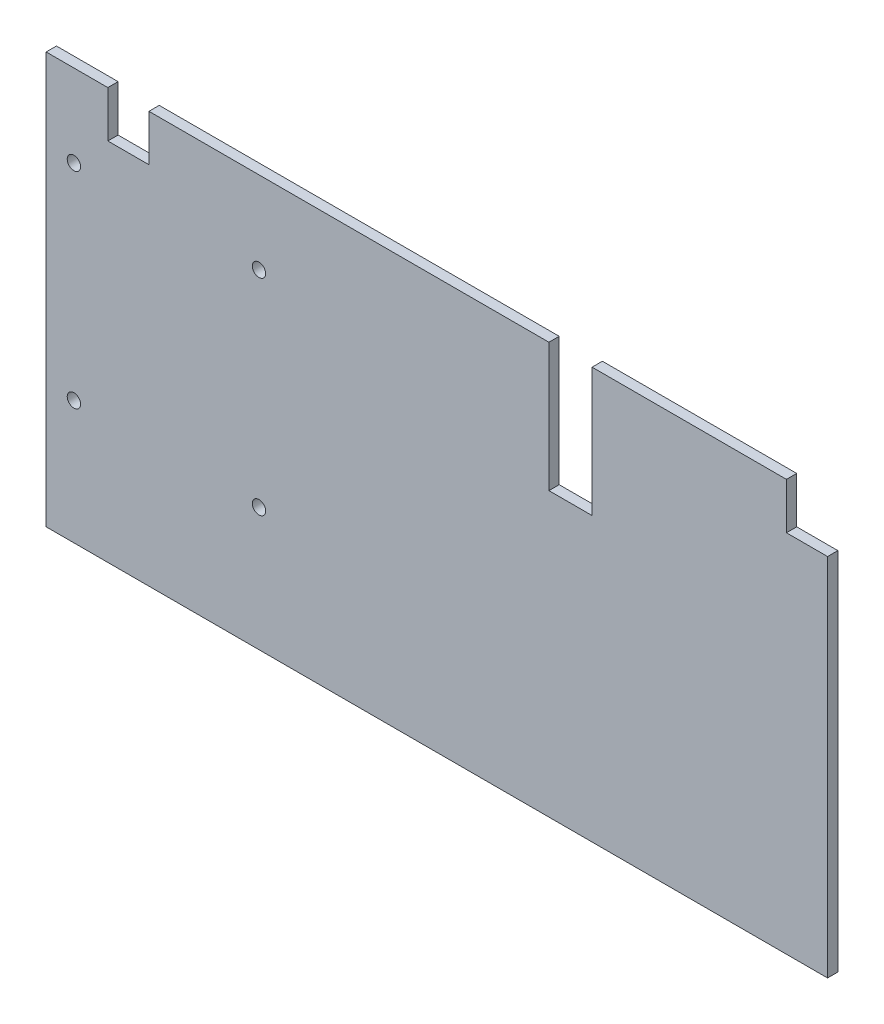
ISO-10303-21;
HEADER;
FILE_DESCRIPTION(('STEP AP214'),'2;1');
FILE_NAME('part.step','',(''),(''),'','','');
FILE_SCHEMA(('AUTOMOTIVE_DESIGN { 1 0 10303 214 1 1 1 1 }'));
ENDSEC;
DATA;
#1=APPLICATION_CONTEXT('core data for automotive mechanical design processes');
#2=APPLICATION_PROTOCOL_DEFINITION('international standard','automotive_design',2000,#1);
#3=PRODUCT_CONTEXT('',#1,'mechanical');
#4=PRODUCT('Part','Part','',(#3));
#5=PRODUCT_RELATED_PRODUCT_CATEGORY('part','',(#4));
#6=PRODUCT_DEFINITION_FORMATION('','',#4);
#7=PRODUCT_DEFINITION_CONTEXT('part definition',#1,'design');
#8=PRODUCT_DEFINITION('design','',#6,#7);
#9=PRODUCT_DEFINITION_SHAPE('','',#8);
#10=(LENGTH_UNIT() NAMED_UNIT(*) SI_UNIT(.MILLI.,.METRE.));
#11=(NAMED_UNIT(*) PLANE_ANGLE_UNIT() SI_UNIT($,.RADIAN.));
#12=(NAMED_UNIT(*) SI_UNIT($,.STERADIAN.) SOLID_ANGLE_UNIT());
#13=UNCERTAINTY_MEASURE_WITH_UNIT(LENGTH_MEASURE(1.E-05),#10,'distance_accuracy_value','');
#14=(GEOMETRIC_REPRESENTATION_CONTEXT(3) GLOBAL_UNCERTAINTY_ASSIGNED_CONTEXT((#13)) GLOBAL_UNIT_ASSIGNED_CONTEXT((#10,
#11,#12)) REPRESENTATION_CONTEXT('',''));
#15=CARTESIAN_POINT('',(0.,0.,0.));
#16=DIRECTION('',(0.,0.,1.));
#17=DIRECTION('',(1.,0.,0.));
#18=AXIS2_PLACEMENT_3D('',#15,#16,#17);
#19=CARTESIAN_POINT('',(0.,0.,10.));
#20=DIRECTION('',(0.,0.,1.));
#21=DIRECTION('',(1.,0.,0.));
#22=AXIS2_PLACEMENT_3D('',#19,#20,#21);
#23=PLANE('',#22);
#24=CARTESIAN_POINT('',(-303.,-100.,10.));
#25=DIRECTION('',(0.,0.,1.));
#26=DIRECTION('',(-1.,0.,0.));
#27=AXIS2_PLACEMENT_3D('',#24,#25,#26);
#28=CIRCLE('',#27,6.50000000000002);
#29=CARTESIAN_POINT('',(-309.5,-100.,10.));
#30=VERTEX_POINT('',#29);
#31=EDGE_CURVE('E321',#30,#30,#28,.T.);
#32=ORIENTED_EDGE('',*,*,#31,.F.);
#33=EDGE_LOOP('',(#32));
#34=FACE_BOUND('',#33,.T.);
#35=CARTESIAN_POINT('',(-303.,100.,10.));
#36=DIRECTION('',(0.,0.,1.));
#37=DIRECTION('',(1.,0.,0.));
#38=AXIS2_PLACEMENT_3D('',#35,#36,#37);
#39=CIRCLE('',#38,6.50000000000002);
#40=CARTESIAN_POINT('',(-296.5,100.,10.));
#41=VERTEX_POINT('',#40);
#42=EDGE_CURVE('E174',#41,#41,#39,.T.);
#43=ORIENTED_EDGE('',*,*,#42,.F.);
#44=EDGE_LOOP('',(#43));
#45=FACE_BOUND('',#44,.T.);
#46=DIRECTION('',(0.,1.,0.));
#47=VECTOR('',#46,1.);
#48=CARTESIAN_POINT('',(-20.9999999999999,55.,10.));
#49=LINE('',#48,#47);
#50=CARTESIAN_POINT('',(-20.9999999999999,55.,10.));
#51=VERTEX_POINT('',#50);
#52=CARTESIAN_POINT('',(-21.,180.,10.));
#53=VERTEX_POINT('',#52);
#54=EDGE_CURVE('E197',#51,#53,#49,.T.);
#55=ORIENTED_EDGE('',*,*,#54,.T.);
#56=DIRECTION('',(-1.,0.,0.));
#57=VECTOR('',#56,1.);
#58=CARTESIAN_POINT('',(-21.,180.,10.));
#59=LINE('',#58,#57);
#60=CARTESIAN_POINT('',(-410.,180.,10.));
#61=VERTEX_POINT('',#60);
#62=EDGE_CURVE('E115',#53,#61,#59,.T.);
#63=ORIENTED_EDGE('',*,*,#62,.T.);
#64=DIRECTION('',(0.,-1.,0.));
#65=VECTOR('',#64,1.);
#66=CARTESIAN_POINT('',(-410.,180.,10.));
#67=LINE('',#66,#65);
#68=CARTESIAN_POINT('',(-410.,135.,10.));
#69=VERTEX_POINT('',#68);
#70=EDGE_CURVE('E230',#61,#69,#67,.T.);
#71=ORIENTED_EDGE('',*,*,#70,.T.);
#72=DIRECTION('',(-1.,0.,0.));
#73=VECTOR('',#72,1.);
#74=CARTESIAN_POINT('',(-410.,135.,10.));
#75=LINE('',#74,#73);
#76=CARTESIAN_POINT('',(-450.,135.,10.));
#77=VERTEX_POINT('',#76);
#78=EDGE_CURVE('E249',#69,#77,#75,.T.);
#79=ORIENTED_EDGE('',*,*,#78,.T.);
#80=DIRECTION('',(0.,1.,0.));
#81=VECTOR('',#80,1.);
#82=CARTESIAN_POINT('',(-450.,135.,10.));
#83=LINE('',#82,#81);
#84=CARTESIAN_POINT('',(-450.,180.,10.));
#85=VERTEX_POINT('',#84);
#86=EDGE_CURVE('E246',#77,#85,#83,.T.);
#87=ORIENTED_EDGE('',*,*,#86,.T.);
#88=DIRECTION('',(-1.,0.,0.));
#89=VECTOR('',#88,1.);
#90=CARTESIAN_POINT('',(-450.,180.,10.));
#91=LINE('',#90,#89);
#92=CARTESIAN_POINT('',(-510.,180.,10.));
#93=VERTEX_POINT('',#92);
#94=EDGE_CURVE('E248',#85,#93,#91,.T.);
#95=ORIENTED_EDGE('',*,*,#94,.T.);
#96=DIRECTION('',(0.,-1.,0.));
#97=VECTOR('',#96,1.);
#98=CARTESIAN_POINT('',(-510.,180.,10.));
#99=LINE('',#98,#97);
#100=CARTESIAN_POINT('',(-510.,-220.,10.));
#101=VERTEX_POINT('',#100);
#102=EDGE_CURVE('E251',#93,#101,#99,.T.);
#103=ORIENTED_EDGE('',*,*,#102,.T.);
#104=DIRECTION('',(1.,0.,0.));
#105=VECTOR('',#104,1.);
#106=CARTESIAN_POINT('',(-510.,-220.,10.));
#107=LINE('',#106,#105);
#108=CARTESIAN_POINT('',(250.,-220.,10.));
#109=VERTEX_POINT('',#108);
#110=EDGE_CURVE('E257',#101,#109,#107,.T.);
#111=ORIENTED_EDGE('',*,*,#110,.T.);
#112=DIRECTION('',(0.,1.,0.));
#113=VECTOR('',#112,1.);
#114=CARTESIAN_POINT('',(250.,135.,10.));
#115=LINE('',#114,#113);
#116=CARTESIAN_POINT('',(250.,135.,10.));
#117=VERTEX_POINT('',#116);
#118=EDGE_CURVE('E259',#109,#117,#115,.T.);
#119=ORIENTED_EDGE('',*,*,#118,.T.);
#120=DIRECTION('',(-1.,0.,0.));
#121=VECTOR('',#120,1.);
#122=CARTESIAN_POINT('',(210.,135.,10.));
#123=LINE('',#122,#121);
#124=CARTESIAN_POINT('',(210.,135.,10.));
#125=VERTEX_POINT('',#124);
#126=EDGE_CURVE('E261',#117,#125,#123,.T.);
#127=ORIENTED_EDGE('',*,*,#126,.T.);
#128=DIRECTION('',(0.,1.,0.));
#129=VECTOR('',#128,1.);
#130=CARTESIAN_POINT('',(210.,180.,10.));
#131=LINE('',#130,#129);
#132=CARTESIAN_POINT('',(210.,180.,10.));
#133=VERTEX_POINT('',#132);
#134=EDGE_CURVE('E152',#125,#133,#131,.T.);
#135=ORIENTED_EDGE('',*,*,#134,.T.);
#136=DIRECTION('',(-1.,0.,0.));
#137=VECTOR('',#136,1.);
#138=CARTESIAN_POINT('',(21.,180.,10.));
#139=LINE('',#138,#137);
#140=CARTESIAN_POINT('',(21.,180.,10.));
#141=VERTEX_POINT('',#140);
#142=EDGE_CURVE('E146',#133,#141,#139,.T.);
#143=ORIENTED_EDGE('',*,*,#142,.T.);
#144=DIRECTION('',(0.,-1.,0.));
#145=VECTOR('',#144,1.);
#146=CARTESIAN_POINT('',(21.0000000000001,55.,10.));
#147=LINE('',#146,#145);
#148=CARTESIAN_POINT('',(21.0000000000001,55.,10.));
#149=VERTEX_POINT('',#148);
#150=EDGE_CURVE('E150',#141,#149,#147,.T.);
#151=ORIENTED_EDGE('',*,*,#150,.T.);
#152=DIRECTION('',(-1.,0.,0.));
#153=VECTOR('',#152,1.);
#154=CARTESIAN_POINT('',(-20.9999999999999,55.,10.));
#155=LINE('',#154,#153);
#156=EDGE_CURVE('E54',#149,#51,#155,.T.);
#157=ORIENTED_EDGE('',*,*,#156,.T.);
#158=EDGE_LOOP('',(#55,#63,#71,#79,#87,#95,#103,#111,#119,#127,#135,#143,#151,#157));
#159=FACE_BOUND('',#158,.T.);
#160=CARTESIAN_POINT('',(-483.,100.,10.));
#161=DIRECTION('',(0.,0.,1.));
#162=DIRECTION('',(-1.,0.,0.));
#163=AXIS2_PLACEMENT_3D('',#160,#161,#162);
#164=CIRCLE('',#163,6.50000000000002);
#165=CARTESIAN_POINT('',(-489.5,100.,10.));
#166=VERTEX_POINT('',#165);
#167=EDGE_CURVE('E327',#166,#166,#164,.T.);
#168=ORIENTED_EDGE('',*,*,#167,.F.);
#169=EDGE_LOOP('',(#168));
#170=FACE_BOUND('',#169,.T.);
#171=CARTESIAN_POINT('',(-483.,-100.,10.));
#172=DIRECTION('',(0.,0.,1.));
#173=DIRECTION('',(1.,0.,0.));
#174=AXIS2_PLACEMENT_3D('',#171,#172,#173);
#175=CIRCLE('',#174,6.50000000000002);
#176=CARTESIAN_POINT('',(-476.5,-100.,10.));
#177=VERTEX_POINT('',#176);
#178=EDGE_CURVE('E312',#177,#177,#175,.T.);
#179=ORIENTED_EDGE('',*,*,#178,.F.);
#180=EDGE_LOOP('',(#179));
#181=FACE_BOUND('',#180,.T.);
#182=ADVANCED_FACE('F37',(#34,#45,#159,#170,#181),#23,.T.);
#183=CARTESIAN_POINT('',(0.,0.,0.));
#184=DIRECTION('',(0.,0.,1.));
#185=DIRECTION('',(1.,0.,0.));
#186=AXIS2_PLACEMENT_3D('',#183,#184,#185);
#187=PLANE('',#186);
#188=DIRECTION('',(0.,1.,0.));
#189=VECTOR('',#188,1.);
#190=CARTESIAN_POINT('',(-20.9999999999999,55.,0.));
#191=LINE('',#190,#189);
#192=CARTESIAN_POINT('',(-20.9999999999999,55.,0.));
#193=VERTEX_POINT('',#192);
#194=CARTESIAN_POINT('',(-21.,180.,0.));
#195=VERTEX_POINT('',#194);
#196=EDGE_CURVE('E170',#193,#195,#191,.T.);
#197=ORIENTED_EDGE('',*,*,#196,.F.);
#198=DIRECTION('',(-1.,0.,0.));
#199=VECTOR('',#198,1.);
#200=CARTESIAN_POINT('',(-20.9999999999999,55.,0.));
#201=LINE('',#200,#199);
#202=CARTESIAN_POINT('',(21.0000000000001,55.,0.));
#203=VERTEX_POINT('',#202);
#204=EDGE_CURVE('E107',#203,#193,#201,.T.);
#205=ORIENTED_EDGE('',*,*,#204,.F.);
#206=DIRECTION('',(0.,-1.,0.));
#207=VECTOR('',#206,1.);
#208=CARTESIAN_POINT('',(21.0000000000001,55.,0.));
#209=LINE('',#208,#207);
#210=CARTESIAN_POINT('',(21.,180.,0.));
#211=VERTEX_POINT('',#210);
#212=EDGE_CURVE('E101',#211,#203,#209,.T.);
#213=ORIENTED_EDGE('',*,*,#212,.F.);
#214=DIRECTION('',(-1.,0.,0.));
#215=VECTOR('',#214,1.);
#216=CARTESIAN_POINT('',(21.,180.,0.));
#217=LINE('',#216,#215);
#218=CARTESIAN_POINT('',(210.,180.,0.));
#219=VERTEX_POINT('',#218);
#220=EDGE_CURVE('E160',#219,#211,#217,.T.);
#221=ORIENTED_EDGE('',*,*,#220,.F.);
#222=DIRECTION('',(0.,1.,0.));
#223=VECTOR('',#222,1.);
#224=CARTESIAN_POINT('',(210.,180.,0.));
#225=LINE('',#224,#223);
#226=CARTESIAN_POINT('',(210.,135.,0.));
#227=VERTEX_POINT('',#226);
#228=EDGE_CURVE('E192',#227,#219,#225,.T.);
#229=ORIENTED_EDGE('',*,*,#228,.F.);
#230=DIRECTION('',(-1.,0.,0.));
#231=VECTOR('',#230,1.);
#232=CARTESIAN_POINT('',(210.,135.,0.));
#233=LINE('',#232,#231);
#234=CARTESIAN_POINT('',(250.,135.,0.));
#235=VERTEX_POINT('',#234);
#236=EDGE_CURVE('E190',#235,#227,#233,.T.);
#237=ORIENTED_EDGE('',*,*,#236,.F.);
#238=DIRECTION('',(0.,1.,0.));
#239=VECTOR('',#238,1.);
#240=CARTESIAN_POINT('',(250.,135.,0.));
#241=LINE('',#240,#239);
#242=CARTESIAN_POINT('',(250.,-220.,0.));
#243=VERTEX_POINT('',#242);
#244=EDGE_CURVE('E188',#243,#235,#241,.T.);
#245=ORIENTED_EDGE('',*,*,#244,.F.);
#246=DIRECTION('',(1.,0.,0.));
#247=VECTOR('',#246,1.);
#248=CARTESIAN_POINT('',(-510.,-220.,0.));
#249=LINE('',#248,#247);
#250=CARTESIAN_POINT('',(-510.,-220.,0.));
#251=VERTEX_POINT('',#250);
#252=EDGE_CURVE('E186',#251,#243,#249,.T.);
#253=ORIENTED_EDGE('',*,*,#252,.F.);
#254=DIRECTION('',(0.,-1.,0.));
#255=VECTOR('',#254,1.);
#256=CARTESIAN_POINT('',(-510.,180.,0.));
#257=LINE('',#256,#255);
#258=CARTESIAN_POINT('',(-510.,180.,0.));
#259=VERTEX_POINT('',#258);
#260=EDGE_CURVE('E184',#259,#251,#257,.T.);
#261=ORIENTED_EDGE('',*,*,#260,.F.);
#262=DIRECTION('',(-1.,0.,0.));
#263=VECTOR('',#262,1.);
#264=CARTESIAN_POINT('',(-450.,180.,0.));
#265=LINE('',#264,#263);
#266=CARTESIAN_POINT('',(-450.,180.,0.));
#267=VERTEX_POINT('',#266);
#268=EDGE_CURVE('E182',#267,#259,#265,.T.);
#269=ORIENTED_EDGE('',*,*,#268,.F.);
#270=DIRECTION('',(0.,1.,0.));
#271=VECTOR('',#270,1.);
#272=CARTESIAN_POINT('',(-450.,135.,0.));
#273=LINE('',#272,#271);
#274=CARTESIAN_POINT('',(-450.,135.,0.));
#275=VERTEX_POINT('',#274);
#276=EDGE_CURVE('E180',#275,#267,#273,.T.);
#277=ORIENTED_EDGE('',*,*,#276,.F.);
#278=DIRECTION('',(-1.,0.,0.));
#279=VECTOR('',#278,1.);
#280=CARTESIAN_POINT('',(-410.,135.,0.));
#281=LINE('',#280,#279);
#282=CARTESIAN_POINT('',(-410.,135.,0.));
#283=VERTEX_POINT('',#282);
#284=EDGE_CURVE('E178',#283,#275,#281,.T.);
#285=ORIENTED_EDGE('',*,*,#284,.F.);
#286=DIRECTION('',(0.,-1.,0.));
#287=VECTOR('',#286,1.);
#288=CARTESIAN_POINT('',(-410.,180.,0.));
#289=LINE('',#288,#287);
#290=CARTESIAN_POINT('',(-410.,180.,0.));
#291=VERTEX_POINT('',#290);
#292=EDGE_CURVE('E176',#291,#283,#289,.T.);
#293=ORIENTED_EDGE('',*,*,#292,.F.);
#294=DIRECTION('',(-1.,0.,0.));
#295=VECTOR('',#294,1.);
#296=CARTESIAN_POINT('',(-21.,180.,0.));
#297=LINE('',#296,#295);
#298=EDGE_CURVE('E173',#195,#291,#297,.T.);
#299=ORIENTED_EDGE('',*,*,#298,.F.);
#300=EDGE_LOOP('',(#197,#205,#213,#221,#229,#237,#245,#253,#261,#269,#277,#285,#293,#299));
#301=FACE_BOUND('',#300,.T.);
#302=CARTESIAN_POINT('',(-303.,100.,0.));
#303=DIRECTION('',(0.,0.,1.));
#304=DIRECTION('',(1.,0.,0.));
#305=AXIS2_PLACEMENT_3D('',#302,#303,#304);
#306=CIRCLE('',#305,6.50000000000002);
#307=CARTESIAN_POINT('',(-296.5,100.,0.));
#308=VERTEX_POINT('',#307);
#309=EDGE_CURVE('E330',#308,#308,#306,.T.);
#310=ORIENTED_EDGE('',*,*,#309,.T.);
#311=EDGE_LOOP('',(#310));
#312=FACE_BOUND('',#311,.T.);
#313=CARTESIAN_POINT('',(-483.,100.,0.));
#314=DIRECTION('',(0.,0.,1.));
#315=DIRECTION('',(-1.,0.,0.));
#316=AXIS2_PLACEMENT_3D('',#313,#314,#315);
#317=CIRCLE('',#316,6.50000000000002);
#318=CARTESIAN_POINT('',(-489.5,100.,0.));
#319=VERTEX_POINT('',#318);
#320=EDGE_CURVE('E324',#319,#319,#317,.T.);
#321=ORIENTED_EDGE('',*,*,#320,.T.);
#322=EDGE_LOOP('',(#321));
#323=FACE_BOUND('',#322,.T.);
#324=CARTESIAN_POINT('',(-303.,-100.,0.));
#325=DIRECTION('',(0.,0.,1.));
#326=DIRECTION('',(-1.,0.,0.));
#327=AXIS2_PLACEMENT_3D('',#324,#325,#326);
#328=CIRCLE('',#327,6.50000000000002);
#329=CARTESIAN_POINT('',(-309.5,-100.,0.));
#330=VERTEX_POINT('',#329);
#331=EDGE_CURVE('E318',#330,#330,#328,.T.);
#332=ORIENTED_EDGE('',*,*,#331,.T.);
#333=EDGE_LOOP('',(#332));
#334=FACE_BOUND('',#333,.T.);
#335=CARTESIAN_POINT('',(-483.,-100.,0.));
#336=DIRECTION('',(0.,0.,1.));
#337=DIRECTION('',(1.,0.,0.));
#338=AXIS2_PLACEMENT_3D('',#335,#336,#337);
#339=CIRCLE('',#338,6.50000000000002);
#340=CARTESIAN_POINT('',(-476.5,-100.,0.));
#341=VERTEX_POINT('',#340);
#342=EDGE_CURVE('E315',#341,#341,#339,.T.);
#343=ORIENTED_EDGE('',*,*,#342,.T.);
#344=EDGE_LOOP('',(#343));
#345=FACE_BOUND('',#344,.T.);
#346=ADVANCED_FACE('F234',(#301,#312,#323,#334,#345),#187,.F.);
#347=CARTESIAN_POINT('',(-20.9999999999999,55.,10.));
#348=DIRECTION('',(-1.,0.,0.));
#349=DIRECTION('',(0.,-1.,0.));
#350=AXIS2_PLACEMENT_3D('',#347,#348,#349);
#351=PLANE('',#350);
#352=ORIENTED_EDGE('',*,*,#196,.T.);
#353=DIRECTION('',(0.,0.,-1.));
#354=VECTOR('',#353,1.);
#355=CARTESIAN_POINT('',(-21.,180.,10.));
#356=LINE('',#355,#354);
#357=EDGE_CURVE('E11',#53,#195,#356,.T.);
#358=ORIENTED_EDGE('',*,*,#357,.F.);
#359=ORIENTED_EDGE('',*,*,#54,.F.);
#360=DIRECTION('',(0.,0.,-1.));
#361=VECTOR('',#360,1.);
#362=CARTESIAN_POINT('',(-20.9999999999999,55.,10.));
#363=LINE('',#362,#361);
#364=EDGE_CURVE('E166',#51,#193,#363,.T.);
#365=ORIENTED_EDGE('',*,*,#364,.T.);
#366=EDGE_LOOP('',(#352,#358,#359,#365));
#367=FACE_BOUND('',#366,.T.);
#368=ADVANCED_FACE('F39',(#367),#351,.F.);
#369=CARTESIAN_POINT('',(-21.,180.,10.));
#370=DIRECTION('',(0.,-1.,0.));
#371=DIRECTION('',(1.,0.,0.));
#372=AXIS2_PLACEMENT_3D('',#369,#370,#371);
#373=PLANE('',#372);
#374=ORIENTED_EDGE('',*,*,#298,.T.);
#375=DIRECTION('',(0.,0.,-1.));
#376=VECTOR('',#375,1.);
#377=CARTESIAN_POINT('',(-410.,180.,10.));
#378=LINE('',#377,#376);
#379=EDGE_CURVE('E46',#61,#291,#378,.T.);
#380=ORIENTED_EDGE('',*,*,#379,.F.);
#381=ORIENTED_EDGE('',*,*,#62,.F.);
#382=ORIENTED_EDGE('',*,*,#357,.T.);
#383=EDGE_LOOP('',(#374,#380,#381,#382));
#384=FACE_BOUND('',#383,.T.);
#385=ADVANCED_FACE('F460',(#384),#373,.F.);
#386=CARTESIAN_POINT('',(-410.,180.,10.));
#387=DIRECTION('',(1.,0.,0.));
#388=DIRECTION('',(0.,0.,-1.));
#389=AXIS2_PLACEMENT_3D('',#386,#387,#388);
#390=PLANE('',#389);
#391=ORIENTED_EDGE('',*,*,#292,.T.);
#392=DIRECTION('',(0.,0.,-1.));
#393=VECTOR('',#392,1.);
#394=CARTESIAN_POINT('',(-410.,135.,10.));
#395=LINE('',#394,#393);
#396=EDGE_CURVE('E222',#69,#283,#395,.T.);
#397=ORIENTED_EDGE('',*,*,#396,.F.);
#398=ORIENTED_EDGE('',*,*,#70,.F.);
#399=ORIENTED_EDGE('',*,*,#379,.T.);
#400=EDGE_LOOP('',(#391,#397,#398,#399));
#401=FACE_BOUND('',#400,.T.);
#402=ADVANCED_FACE('F228',(#401),#390,.F.);
#403=CARTESIAN_POINT('',(-410.,135.,10.));
#404=DIRECTION('',(0.,-1.,0.));
#405=DIRECTION('',(0.,0.,-1.));
#406=AXIS2_PLACEMENT_3D('',#403,#404,#405);
#407=PLANE('',#406);
#408=ORIENTED_EDGE('',*,*,#284,.T.);
#409=DIRECTION('',(0.,0.,-1.));
#410=VECTOR('',#409,1.);
#411=CARTESIAN_POINT('',(-450.,135.,10.));
#412=LINE('',#411,#410);
#413=EDGE_CURVE('E219',#77,#275,#412,.T.);
#414=ORIENTED_EDGE('',*,*,#413,.F.);
#415=ORIENTED_EDGE('',*,*,#78,.F.);
#416=ORIENTED_EDGE('',*,*,#396,.T.);
#417=EDGE_LOOP('',(#408,#414,#415,#416));
#418=FACE_BOUND('',#417,.T.);
#419=ADVANCED_FACE('F240',(#418),#407,.F.);
#420=CARTESIAN_POINT('',(-450.,135.,10.));
#421=DIRECTION('',(-1.,0.,0.));
#422=DIRECTION('',(0.,0.,1.));
#423=AXIS2_PLACEMENT_3D('',#420,#421,#422);
#424=PLANE('',#423);
#425=ORIENTED_EDGE('',*,*,#276,.T.);
#426=DIRECTION('',(0.,0.,-1.));
#427=VECTOR('',#426,1.);
#428=CARTESIAN_POINT('',(-450.,180.,10.));
#429=LINE('',#428,#427);
#430=EDGE_CURVE('E216',#85,#267,#429,.T.);
#431=ORIENTED_EDGE('',*,*,#430,.F.);
#432=ORIENTED_EDGE('',*,*,#86,.F.);
#433=ORIENTED_EDGE('',*,*,#413,.T.);
#434=EDGE_LOOP('',(#425,#431,#432,#433));
#435=FACE_BOUND('',#434,.T.);
#436=ADVANCED_FACE('F244',(#435),#424,.F.);
#437=CARTESIAN_POINT('',(-450.,180.,10.));
#438=DIRECTION('',(0.,-1.,0.));
#439=DIRECTION('',(0.,0.,-1.));
#440=AXIS2_PLACEMENT_3D('',#437,#438,#439);
#441=PLANE('',#440);
#442=ORIENTED_EDGE('',*,*,#268,.T.);
#443=DIRECTION('',(0.,0.,-1.));
#444=VECTOR('',#443,1.);
#445=CARTESIAN_POINT('',(-510.,180.,10.));
#446=LINE('',#445,#444);
#447=EDGE_CURVE('E213',#93,#259,#446,.T.);
#448=ORIENTED_EDGE('',*,*,#447,.F.);
#449=ORIENTED_EDGE('',*,*,#94,.F.);
#450=ORIENTED_EDGE('',*,*,#430,.T.);
#451=EDGE_LOOP('',(#442,#448,#449,#450));
#452=FACE_BOUND('',#451,.T.);
#453=ADVANCED_FACE('F425',(#452),#441,.F.);
#454=CARTESIAN_POINT('',(-510.,180.,10.));
#455=DIRECTION('',(1.,0.,0.));
#456=DIRECTION('',(0.,0.,-1.));
#457=AXIS2_PLACEMENT_3D('',#454,#455,#456);
#458=PLANE('',#457);
#459=ORIENTED_EDGE('',*,*,#260,.T.);
#460=DIRECTION('',(0.,0.,-1.));
#461=VECTOR('',#460,1.);
#462=CARTESIAN_POINT('',(-510.,-220.,10.));
#463=LINE('',#462,#461);
#464=EDGE_CURVE('E210',#101,#251,#463,.T.);
#465=ORIENTED_EDGE('',*,*,#464,.F.);
#466=ORIENTED_EDGE('',*,*,#102,.F.);
#467=ORIENTED_EDGE('',*,*,#447,.T.);
#468=EDGE_LOOP('',(#459,#465,#466,#467));
#469=FACE_BOUND('',#468,.T.);
#470=ADVANCED_FACE('F415',(#469),#458,.F.);
#471=CARTESIAN_POINT('',(-510.,-220.,10.));
#472=DIRECTION('',(0.,1.,0.));
#473=DIRECTION('',(0.,0.,1.));
#474=AXIS2_PLACEMENT_3D('',#471,#472,#473);
#475=PLANE('',#474);
#476=ORIENTED_EDGE('',*,*,#252,.T.);
#477=DIRECTION('',(0.,0.,-1.));
#478=VECTOR('',#477,1.);
#479=CARTESIAN_POINT('',(250.,-220.,10.));
#480=LINE('',#479,#478);
#481=EDGE_CURVE('E207',#109,#243,#480,.T.);
#482=ORIENTED_EDGE('',*,*,#481,.F.);
#483=ORIENTED_EDGE('',*,*,#110,.F.);
#484=ORIENTED_EDGE('',*,*,#464,.T.);
#485=EDGE_LOOP('',(#476,#482,#483,#484));
#486=FACE_BOUND('',#485,.T.);
#487=ADVANCED_FACE('F405',(#486),#475,.F.);
#488=CARTESIAN_POINT('',(250.,135.,10.));
#489=DIRECTION('',(-1.,0.,0.));
#490=DIRECTION('',(0.,-1.,0.));
#491=AXIS2_PLACEMENT_3D('',#488,#489,#490);
#492=PLANE('',#491);
#493=ORIENTED_EDGE('',*,*,#244,.T.);
#494=DIRECTION('',(0.,0.,-1.));
#495=VECTOR('',#494,1.);
#496=CARTESIAN_POINT('',(250.,135.,10.));
#497=LINE('',#496,#495);
#498=EDGE_CURVE('E204',#117,#235,#497,.T.);
#499=ORIENTED_EDGE('',*,*,#498,.F.);
#500=ORIENTED_EDGE('',*,*,#118,.F.);
#501=ORIENTED_EDGE('',*,*,#481,.T.);
#502=EDGE_LOOP('',(#493,#499,#500,#501));
#503=FACE_BOUND('',#502,.T.);
#504=ADVANCED_FACE('F396',(#503),#492,.F.);
#505=CARTESIAN_POINT('',(210.,135.,10.));
#506=DIRECTION('',(0.,-1.,0.));
#507=DIRECTION('',(0.,0.,-1.));
#508=AXIS2_PLACEMENT_3D('',#505,#506,#507);
#509=PLANE('',#508);
#510=ORIENTED_EDGE('',*,*,#236,.T.);
#511=DIRECTION('',(0.,0.,-1.));
#512=VECTOR('',#511,1.);
#513=CARTESIAN_POINT('',(210.,135.,10.));
#514=LINE('',#513,#512);
#515=EDGE_CURVE('E201',#125,#227,#514,.T.);
#516=ORIENTED_EDGE('',*,*,#515,.F.);
#517=ORIENTED_EDGE('',*,*,#126,.F.);
#518=ORIENTED_EDGE('',*,*,#498,.T.);
#519=EDGE_LOOP('',(#510,#516,#517,#518));
#520=FACE_BOUND('',#519,.T.);
#521=ADVANCED_FACE('F267',(#520),#509,.F.);
#522=CARTESIAN_POINT('',(210.,180.,10.));
#523=DIRECTION('',(-1.,0.,0.));
#524=DIRECTION('',(0.,-1.,0.));
#525=AXIS2_PLACEMENT_3D('',#522,#523,#524);
#526=PLANE('',#525);
#527=ORIENTED_EDGE('',*,*,#228,.T.);
#528=DIRECTION('',(0.,0.,-1.));
#529=VECTOR('',#528,1.);
#530=CARTESIAN_POINT('',(210.,180.,10.));
#531=LINE('',#530,#529);
#532=EDGE_CURVE('E161',#133,#219,#531,.T.);
#533=ORIENTED_EDGE('',*,*,#532,.F.);
#534=ORIENTED_EDGE('',*,*,#134,.F.);
#535=ORIENTED_EDGE('',*,*,#515,.T.);
#536=EDGE_LOOP('',(#527,#533,#534,#535));
#537=FACE_BOUND('',#536,.T.);
#538=ADVANCED_FACE('F271',(#537),#526,.F.);
#539=CARTESIAN_POINT('',(21.,180.,10.));
#540=DIRECTION('',(0.,-1.,0.));
#541=DIRECTION('',(0.,0.,-1.));
#542=AXIS2_PLACEMENT_3D('',#539,#540,#541);
#543=PLANE('',#542);
#544=ORIENTED_EDGE('',*,*,#220,.T.);
#545=DIRECTION('',(0.,0.,-1.));
#546=VECTOR('',#545,1.);
#547=CARTESIAN_POINT('',(21.,180.,10.));
#548=LINE('',#547,#546);
#549=EDGE_CURVE('E157',#141,#211,#548,.T.);
#550=ORIENTED_EDGE('',*,*,#549,.F.);
#551=ORIENTED_EDGE('',*,*,#142,.F.);
#552=ORIENTED_EDGE('',*,*,#532,.T.);
#553=EDGE_LOOP('',(#544,#550,#551,#552));
#554=FACE_BOUND('',#553,.T.);
#555=ADVANCED_FACE('F158',(#554),#543,.F.);
#556=CARTESIAN_POINT('',(21.0000000000001,55.,10.));
#557=DIRECTION('',(1.,0.,0.));
#558=DIRECTION('',(0.,1.,0.));
#559=AXIS2_PLACEMENT_3D('',#556,#557,#558);
#560=PLANE('',#559);
#561=ORIENTED_EDGE('',*,*,#212,.T.);
#562=DIRECTION('',(0.,0.,-1.));
#563=VECTOR('',#562,1.);
#564=CARTESIAN_POINT('',(21.0000000000001,55.,10.));
#565=LINE('',#564,#563);
#566=EDGE_CURVE('E162',#149,#203,#565,.T.);
#567=ORIENTED_EDGE('',*,*,#566,.F.);
#568=ORIENTED_EDGE('',*,*,#150,.F.);
#569=ORIENTED_EDGE('',*,*,#549,.T.);
#570=EDGE_LOOP('',(#561,#567,#568,#569));
#571=FACE_BOUND('',#570,.T.);
#572=ADVANCED_FACE('F164',(#571),#560,.F.);
#573=CARTESIAN_POINT('',(-20.9999999999999,55.,10.));
#574=DIRECTION('',(0.,-1.,0.));
#575=DIRECTION('',(1.,0.,0.));
#576=AXIS2_PLACEMENT_3D('',#573,#574,#575);
#577=PLANE('',#576);
#578=ORIENTED_EDGE('',*,*,#204,.T.);
#579=ORIENTED_EDGE('',*,*,#364,.F.);
#580=ORIENTED_EDGE('',*,*,#156,.F.);
#581=ORIENTED_EDGE('',*,*,#566,.T.);
#582=EDGE_LOOP('',(#578,#579,#580,#581));
#583=FACE_BOUND('',#582,.T.);
#584=ADVANCED_FACE('F275',(#583),#577,.F.);
#585=CARTESIAN_POINT('',(-303.,100.,10.));
#586=DIRECTION('',(0.,0.,-1.));
#587=DIRECTION('',(-1.,0.,0.));
#588=AXIS2_PLACEMENT_3D('',#585,#586,#587);
#589=CYLINDRICAL_SURFACE('',#588,6.50000000000002);
#590=ORIENTED_EDGE('',*,*,#42,.T.);
#591=EDGE_LOOP('',(#590));
#592=FACE_BOUND('',#591,.T.);
#593=ORIENTED_EDGE('',*,*,#309,.F.);
#594=EDGE_LOOP('',(#593));
#595=FACE_BOUND('',#594,.T.);
#596=ADVANCED_FACE('F277',(#592,#595),#589,.F.);
#597=CARTESIAN_POINT('',(-483.,100.,10.));
#598=DIRECTION('',(0.,0.,-1.));
#599=DIRECTION('',(-1.,0.,0.));
#600=AXIS2_PLACEMENT_3D('',#597,#598,#599);
#601=CYLINDRICAL_SURFACE('',#600,6.50000000000002);
#602=ORIENTED_EDGE('',*,*,#167,.T.);
#603=EDGE_LOOP('',(#602));
#604=FACE_BOUND('',#603,.T.);
#605=ORIENTED_EDGE('',*,*,#320,.F.);
#606=EDGE_LOOP('',(#605));
#607=FACE_BOUND('',#606,.T.);
#608=ADVANCED_FACE('F283',(#604,#607),#601,.F.);
#609=CARTESIAN_POINT('',(-303.,-100.,10.));
#610=DIRECTION('',(0.,0.,-1.));
#611=DIRECTION('',(-1.,0.,0.));
#612=AXIS2_PLACEMENT_3D('',#609,#610,#611);
#613=CYLINDRICAL_SURFACE('',#612,6.50000000000002);
#614=ORIENTED_EDGE('',*,*,#31,.T.);
#615=EDGE_LOOP('',(#614));
#616=FACE_BOUND('',#615,.T.);
#617=ORIENTED_EDGE('',*,*,#331,.F.);
#618=EDGE_LOOP('',(#617));
#619=FACE_BOUND('',#618,.T.);
#620=ADVANCED_FACE('F299',(#616,#619),#613,.F.);
#621=CARTESIAN_POINT('',(-483.,-100.,10.));
#622=DIRECTION('',(0.,0.,-1.));
#623=DIRECTION('',(-1.,0.,0.));
#624=AXIS2_PLACEMENT_3D('',#621,#622,#623);
#625=CYLINDRICAL_SURFACE('',#624,6.50000000000002);
#626=ORIENTED_EDGE('',*,*,#178,.T.);
#627=EDGE_LOOP('',(#626));
#628=FACE_BOUND('',#627,.T.);
#629=ORIENTED_EDGE('',*,*,#342,.F.);
#630=EDGE_LOOP('',(#629));
#631=FACE_BOUND('',#630,.T.);
#632=ADVANCED_FACE('F303',(#628,#631),#625,.F.);
#633=CLOSED_SHELL('',(#182,#346,#368,#385,#402,#419,#436,#453,#470,#487,#504,#521,#538,#555,
#572,#584,#596,#608,#620,#632));
#634=MANIFOLD_SOLID_BREP('B2',#633);
#635=ADVANCED_BREP_SHAPE_REPRESENTATION('',(#18,#634),#14);
#636=SHAPE_DEFINITION_REPRESENTATION(#9,#635);
ENDSEC;
END-ISO-10303-21;
